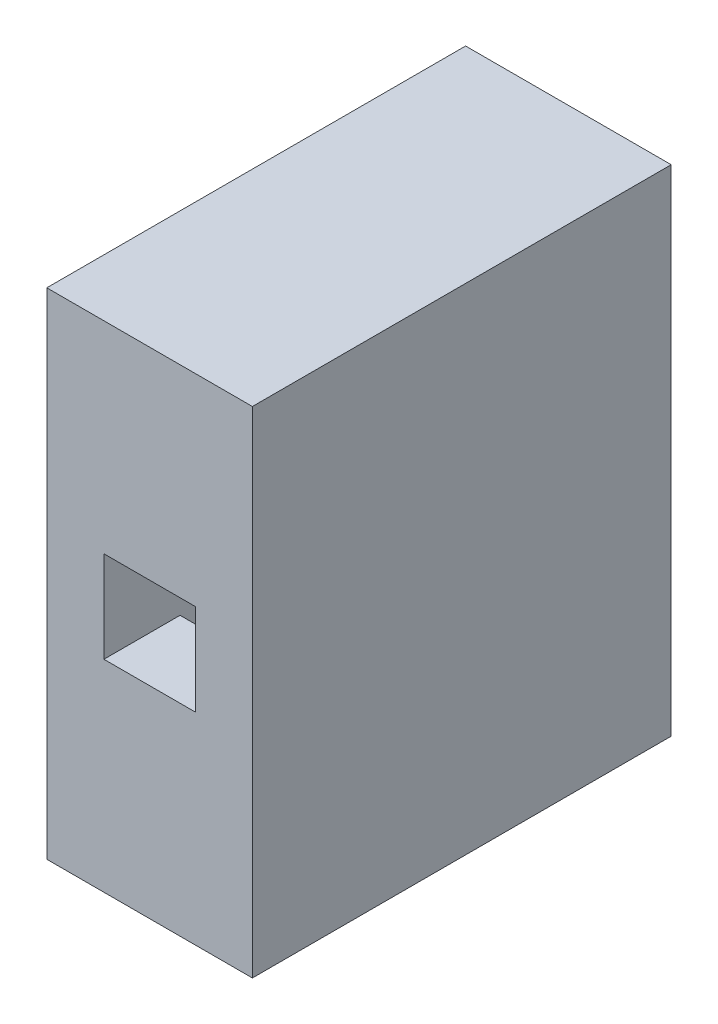
ISO-10303-21;
HEADER;
FILE_DESCRIPTION(('STEP AP214'),'2;1');
FILE_NAME('part.step','',(''),(''),'','','');
FILE_SCHEMA(('AUTOMOTIVE_DESIGN { 1 0 10303 214 1 1 1 1 }'));
ENDSEC;
DATA;
#1=APPLICATION_CONTEXT('core data for automotive mechanical design processes');
#2=APPLICATION_PROTOCOL_DEFINITION('international standard','automotive_design',2000,#1);
#3=PRODUCT_CONTEXT('',#1,'mechanical');
#4=PRODUCT('Part','Part','',(#3));
#5=PRODUCT_RELATED_PRODUCT_CATEGORY('part','',(#4));
#6=PRODUCT_DEFINITION_FORMATION('','',#4);
#7=PRODUCT_DEFINITION_CONTEXT('part definition',#1,'design');
#8=PRODUCT_DEFINITION('design','',#6,#7);
#9=PRODUCT_DEFINITION_SHAPE('','',#8);
#10=(LENGTH_UNIT() NAMED_UNIT(*) SI_UNIT(.MILLI.,.METRE.));
#11=(NAMED_UNIT(*) PLANE_ANGLE_UNIT() SI_UNIT($,.RADIAN.));
#12=(NAMED_UNIT(*) SI_UNIT($,.STERADIAN.) SOLID_ANGLE_UNIT());
#13=UNCERTAINTY_MEASURE_WITH_UNIT(LENGTH_MEASURE(1.E-05),#10,'distance_accuracy_value','');
#14=(GEOMETRIC_REPRESENTATION_CONTEXT(3) GLOBAL_UNCERTAINTY_ASSIGNED_CONTEXT((#13)) GLOBAL_UNIT_ASSIGNED_CONTEXT((#10,
#11,#12)) REPRESENTATION_CONTEXT('',''));
#15=CARTESIAN_POINT('',(0.,0.,0.));
#16=DIRECTION('',(0.,0.,1.));
#17=DIRECTION('',(1.,0.,0.));
#18=AXIS2_PLACEMENT_3D('',#15,#16,#17);
#19=CARTESIAN_POINT('',(0.,-13.,18.));
#20=DIRECTION('',(0.,1.,0.));
#21=DIRECTION('',(0.,0.,1.));
#22=AXIS2_PLACEMENT_3D('',#19,#20,#21);
#23=PLANE('',#22);
#24=DIRECTION('',(1.,0.,0.));
#25=VECTOR('',#24,1.);
#26=CARTESIAN_POINT('',(0.,-13.,0.));
#27=LINE('',#26,#25);
#28=CARTESIAN_POINT('',(-5.4,-13.,0.));
#29=VERTEX_POINT('',#28);
#30=CARTESIAN_POINT('',(5.4,-13.,0.));
#31=VERTEX_POINT('',#30);
#32=EDGE_CURVE('E206',#29,#31,#27,.T.);
#33=ORIENTED_EDGE('',*,*,#32,.T.);
#34=DIRECTION('',(0.,0.,-1.));
#35=VECTOR('',#34,1.);
#36=CARTESIAN_POINT('',(5.4,-13.,18.));
#37=LINE('',#36,#35);
#38=CARTESIAN_POINT('',(5.4,-13.,22.));
#39=VERTEX_POINT('',#38);
#40=EDGE_CURVE('E11',#39,#31,#37,.T.);
#41=ORIENTED_EDGE('',*,*,#40,.F.);
#42=DIRECTION('',(1.,0.,0.));
#43=VECTOR('',#42,1.);
#44=CARTESIAN_POINT('',(-5.4,-13.,22.));
#45=LINE('',#44,#43);
#46=CARTESIAN_POINT('',(-5.4,-13.,22.));
#47=VERTEX_POINT('',#46);
#48=EDGE_CURVE('E167',#47,#39,#45,.T.);
#49=ORIENTED_EDGE('',*,*,#48,.F.);
#50=DIRECTION('',(0.,0.,-1.));
#51=VECTOR('',#50,1.);
#52=CARTESIAN_POINT('',(-5.4,-13.,18.));
#53=LINE('',#52,#51);
#54=EDGE_CURVE('E184',#47,#29,#53,.T.);
#55=ORIENTED_EDGE('',*,*,#54,.T.);
#56=EDGE_LOOP('',(#33,#41,#49,#55));
#57=FACE_BOUND('',#56,.T.);
#58=ADVANCED_FACE('F35',(#57),#23,.F.);
#59=CARTESIAN_POINT('',(5.4,0.,18.));
#60=DIRECTION('',(-1.,0.,0.));
#61=DIRECTION('',(0.,0.,1.));
#62=AXIS2_PLACEMENT_3D('',#59,#60,#61);
#63=PLANE('',#62);
#64=DIRECTION('',(0.,1.,0.));
#65=VECTOR('',#64,1.);
#66=CARTESIAN_POINT('',(5.4,0.,0.));
#67=LINE('',#66,#65);
#68=CARTESIAN_POINT('',(5.4,13.,0.));
#69=VERTEX_POINT('',#68);
#70=EDGE_CURVE('E203',#31,#69,#67,.T.);
#71=ORIENTED_EDGE('',*,*,#70,.T.);
#72=DIRECTION('',(0.,0.,-1.));
#73=VECTOR('',#72,1.);
#74=CARTESIAN_POINT('',(5.4,13.,18.));
#75=LINE('',#74,#73);
#76=CARTESIAN_POINT('',(5.4,13.,22.));
#77=VERTEX_POINT('',#76);
#78=EDGE_CURVE('E44',#77,#69,#75,.T.);
#79=ORIENTED_EDGE('',*,*,#78,.F.);
#80=DIRECTION('',(0.,1.,0.));
#81=VECTOR('',#80,1.);
#82=CARTESIAN_POINT('',(5.4,-13.,22.));
#83=LINE('',#82,#81);
#84=EDGE_CURVE('E148',#39,#77,#83,.T.);
#85=ORIENTED_EDGE('',*,*,#84,.F.);
#86=ORIENTED_EDGE('',*,*,#40,.T.);
#87=EDGE_LOOP('',(#71,#79,#85,#86));
#88=FACE_BOUND('',#87,.T.);
#89=ADVANCED_FACE('F268',(#88),#63,.F.);
#90=CARTESIAN_POINT('',(0.,13.,18.));
#91=DIRECTION('',(0.,1.,0.));
#92=DIRECTION('',(0.,0.,1.));
#93=AXIS2_PLACEMENT_3D('',#90,#91,#92);
#94=PLANE('',#93);
#95=DIRECTION('',(1.,0.,0.));
#96=VECTOR('',#95,1.);
#97=CARTESIAN_POINT('',(0.,13.,0.));
#98=LINE('',#97,#96);
#99=CARTESIAN_POINT('',(-5.4,13.,0.));
#100=VERTEX_POINT('',#99);
#101=EDGE_CURVE('E200',#100,#69,#98,.T.);
#102=ORIENTED_EDGE('',*,*,#101,.F.);
#103=DIRECTION('',(0.,0.,-1.));
#104=VECTOR('',#103,1.);
#105=CARTESIAN_POINT('',(-5.4,13.,18.));
#106=LINE('',#105,#104);
#107=CARTESIAN_POINT('',(-5.4,13.,22.));
#108=VERTEX_POINT('',#107);
#109=EDGE_CURVE('E194',#108,#100,#106,.T.);
#110=ORIENTED_EDGE('',*,*,#109,.F.);
#111=DIRECTION('',(-1.,0.,0.));
#112=VECTOR('',#111,1.);
#113=CARTESIAN_POINT('',(-5.4,13.,22.));
#114=LINE('',#113,#112);
#115=EDGE_CURVE('E161',#77,#108,#114,.T.);
#116=ORIENTED_EDGE('',*,*,#115,.F.);
#117=ORIENTED_EDGE('',*,*,#78,.T.);
#118=EDGE_LOOP('',(#102,#110,#116,#117));
#119=FACE_BOUND('',#118,.T.);
#120=ADVANCED_FACE('F274',(#119),#94,.T.);
#121=CARTESIAN_POINT('',(2.4,0.,18.));
#122=DIRECTION('',(-1.,0.,0.));
#123=DIRECTION('',(0.,0.,1.));
#124=AXIS2_PLACEMENT_3D('',#121,#122,#123);
#125=PLANE('',#124);
#126=DIRECTION('',(0.,1.,0.));
#127=VECTOR('',#126,1.);
#128=CARTESIAN_POINT('',(2.4,0.,0.));
#129=LINE('',#128,#127);
#130=CARTESIAN_POINT('',(2.4,-10.,0.));
#131=VERTEX_POINT('',#130);
#132=CARTESIAN_POINT('',(2.4,10.,0.));
#133=VERTEX_POINT('',#132);
#134=EDGE_CURVE('E170',#131,#133,#129,.T.);
#135=ORIENTED_EDGE('',*,*,#134,.F.);
#136=DIRECTION('',(0.,0.,-1.));
#137=VECTOR('',#136,1.);
#138=CARTESIAN_POINT('',(2.4,-10.,18.));
#139=LINE('',#138,#137);
#140=CARTESIAN_POINT('',(2.4,-10.,18.));
#141=VERTEX_POINT('',#140);
#142=EDGE_CURVE('E182',#141,#131,#139,.T.);
#143=ORIENTED_EDGE('',*,*,#142,.F.);
#144=DIRECTION('',(0.,1.,0.));
#145=VECTOR('',#144,1.);
#146=CARTESIAN_POINT('',(2.4,0.,18.));
#147=LINE('',#146,#145);
#148=CARTESIAN_POINT('',(2.4,-2.4,18.));
#149=VERTEX_POINT('',#148);
#150=EDGE_CURVE('E180',#141,#149,#147,.T.);
#151=ORIENTED_EDGE('',*,*,#150,.T.);
#152=DIRECTION('',(0.,0.,-1.));
#153=VECTOR('',#152,1.);
#154=CARTESIAN_POINT('',(2.4,-2.4,22.));
#155=LINE('',#154,#153);
#156=CARTESIAN_POINT('',(2.4,-2.4,22.));
#157=VERTEX_POINT('',#156);
#158=EDGE_CURVE('E136',#157,#149,#155,.T.);
#159=ORIENTED_EDGE('',*,*,#158,.F.);
#160=DIRECTION('',(0.,1.,0.));
#161=VECTOR('',#160,1.);
#162=CARTESIAN_POINT('',(2.4,2.4,22.));
#163=LINE('',#162,#161);
#164=CARTESIAN_POINT('',(2.4,2.4,22.));
#165=VERTEX_POINT('',#164);
#166=EDGE_CURVE('E130',#157,#165,#163,.T.);
#167=ORIENTED_EDGE('',*,*,#166,.T.);
#168=DIRECTION('',(0.,0.,-1.));
#169=VECTOR('',#168,1.);
#170=CARTESIAN_POINT('',(2.4,2.4,22.));
#171=LINE('',#170,#169);
#172=CARTESIAN_POINT('',(2.4,2.4,18.));
#173=VERTEX_POINT('',#172);
#174=EDGE_CURVE('E134',#165,#173,#171,.T.);
#175=ORIENTED_EDGE('',*,*,#174,.T.);
#176=CARTESIAN_POINT('',(2.4,10.,18.));
#177=VERTEX_POINT('',#176);
#178=EDGE_CURVE('E177',#173,#177,#147,.T.);
#179=ORIENTED_EDGE('',*,*,#178,.T.);
#180=DIRECTION('',(0.,0.,-1.));
#181=VECTOR('',#180,1.);
#182=CARTESIAN_POINT('',(2.4,10.,18.));
#183=LINE('',#182,#181);
#184=EDGE_CURVE('E190',#177,#133,#183,.T.);
#185=ORIENTED_EDGE('',*,*,#184,.T.);
#186=EDGE_LOOP('',(#135,#143,#151,#159,#167,#175,#179,#185));
#187=FACE_BOUND('',#186,.T.);
#188=ADVANCED_FACE('F37',(#187),#125,.T.);
#189=CARTESIAN_POINT('',(0.,-10.,18.));
#190=DIRECTION('',(0.,1.,0.));
#191=DIRECTION('',(0.,0.,1.));
#192=AXIS2_PLACEMENT_3D('',#189,#190,#191);
#193=PLANE('',#192);
#194=DIRECTION('',(1.,0.,0.));
#195=VECTOR('',#194,1.);
#196=CARTESIAN_POINT('',(0.,-10.,0.));
#197=LINE('',#196,#195);
#198=CARTESIAN_POINT('',(-2.4,-10.,0.));
#199=VERTEX_POINT('',#198);
#200=EDGE_CURVE('E214',#199,#131,#197,.T.);
#201=ORIENTED_EDGE('',*,*,#200,.F.);
#202=DIRECTION('',(0.,0.,-1.));
#203=VECTOR('',#202,1.);
#204=CARTESIAN_POINT('',(-2.4,-10.,18.));
#205=LINE('',#204,#203);
#206=CARTESIAN_POINT('',(-2.4,-10.,18.));
#207=VERTEX_POINT('',#206);
#208=EDGE_CURVE('E185',#207,#199,#205,.T.);
#209=ORIENTED_EDGE('',*,*,#208,.F.);
#210=DIRECTION('',(1.,0.,0.));
#211=VECTOR('',#210,1.);
#212=CARTESIAN_POINT('',(0.,-10.,18.));
#213=LINE('',#212,#211);
#214=EDGE_CURVE('E173',#207,#141,#213,.T.);
#215=ORIENTED_EDGE('',*,*,#214,.T.);
#216=ORIENTED_EDGE('',*,*,#142,.T.);
#217=EDGE_LOOP('',(#201,#209,#215,#216));
#218=FACE_BOUND('',#217,.T.);
#219=ADVANCED_FACE('F229',(#218),#193,.T.);
#220=CARTESIAN_POINT('',(-2.4,0.,18.));
#221=DIRECTION('',(-1.,0.,0.));
#222=DIRECTION('',(0.,0.,1.));
#223=AXIS2_PLACEMENT_3D('',#220,#221,#222);
#224=PLANE('',#223);
#225=DIRECTION('',(0.,1.,0.));
#226=VECTOR('',#225,1.);
#227=CARTESIAN_POINT('',(-2.4,0.,0.));
#228=LINE('',#227,#226);
#229=CARTESIAN_POINT('',(-2.4,10.,0.));
#230=VERTEX_POINT('',#229);
#231=EDGE_CURVE('E212',#199,#230,#228,.T.);
#232=ORIENTED_EDGE('',*,*,#231,.T.);
#233=DIRECTION('',(0.,0.,-1.));
#234=VECTOR('',#233,1.);
#235=CARTESIAN_POINT('',(-2.4,10.,18.));
#236=LINE('',#235,#234);
#237=CARTESIAN_POINT('',(-2.4,10.,18.));
#238=VERTEX_POINT('',#237);
#239=EDGE_CURVE('E187',#238,#230,#236,.T.);
#240=ORIENTED_EDGE('',*,*,#239,.F.);
#241=DIRECTION('',(0.,1.,0.));
#242=VECTOR('',#241,1.);
#243=CARTESIAN_POINT('',(-2.4,0.,18.));
#244=LINE('',#243,#242);
#245=CARTESIAN_POINT('',(-2.4,2.4,18.));
#246=VERTEX_POINT('',#245);
#247=EDGE_CURVE('E52',#246,#238,#244,.T.);
#248=ORIENTED_EDGE('',*,*,#247,.F.);
#249=DIRECTION('',(0.,0.,-1.));
#250=VECTOR('',#249,1.);
#251=CARTESIAN_POINT('',(-2.4,2.4,22.));
#252=LINE('',#251,#250);
#253=CARTESIAN_POINT('',(-2.4,2.4,22.));
#254=VERTEX_POINT('',#253);
#255=EDGE_CURVE('E149',#254,#246,#252,.T.);
#256=ORIENTED_EDGE('',*,*,#255,.F.);
#257=DIRECTION('',(0.,-1.,0.));
#258=VECTOR('',#257,1.);
#259=CARTESIAN_POINT('',(-2.4,2.4,22.));
#260=LINE('',#259,#258);
#261=CARTESIAN_POINT('',(-2.4,-2.4,22.));
#262=VERTEX_POINT('',#261);
#263=EDGE_CURVE('E153',#254,#262,#260,.T.);
#264=ORIENTED_EDGE('',*,*,#263,.T.);
#265=DIRECTION('',(0.,0.,-1.));
#266=VECTOR('',#265,1.);
#267=CARTESIAN_POINT('',(-2.4,-2.4,22.));
#268=LINE('',#267,#266);
#269=CARTESIAN_POINT('',(-2.4,-2.4,18.));
#270=VERTEX_POINT('',#269);
#271=EDGE_CURVE('E234',#262,#270,#268,.T.);
#272=ORIENTED_EDGE('',*,*,#271,.T.);
#273=EDGE_CURVE('E60',#207,#270,#244,.T.);
#274=ORIENTED_EDGE('',*,*,#273,.F.);
#275=ORIENTED_EDGE('',*,*,#208,.T.);
#276=EDGE_LOOP('',(#232,#240,#248,#256,#264,#272,#274,#275));
#277=FACE_BOUND('',#276,.T.);
#278=ADVANCED_FACE('F258',(#277),#224,.F.);
#279=CARTESIAN_POINT('',(0.,10.,18.));
#280=DIRECTION('',(0.,1.,0.));
#281=DIRECTION('',(0.,0.,1.));
#282=AXIS2_PLACEMENT_3D('',#279,#280,#281);
#283=PLANE('',#282);
#284=DIRECTION('',(1.,0.,0.));
#285=VECTOR('',#284,1.);
#286=CARTESIAN_POINT('',(0.,10.,0.));
#287=LINE('',#286,#285);
#288=EDGE_CURVE('E209',#230,#133,#287,.T.);
#289=ORIENTED_EDGE('',*,*,#288,.T.);
#290=ORIENTED_EDGE('',*,*,#184,.F.);
#291=DIRECTION('',(1.,0.,0.));
#292=VECTOR('',#291,1.);
#293=CARTESIAN_POINT('',(0.,10.,18.));
#294=LINE('',#293,#292);
#295=EDGE_CURVE('E191',#238,#177,#294,.T.);
#296=ORIENTED_EDGE('',*,*,#295,.F.);
#297=ORIENTED_EDGE('',*,*,#239,.T.);
#298=EDGE_LOOP('',(#289,#290,#296,#297));
#299=FACE_BOUND('',#298,.T.);
#300=ADVANCED_FACE('F253',(#299),#283,.F.);
#301=CARTESIAN_POINT('',(-5.4,0.,18.));
#302=DIRECTION('',(-1.,0.,0.));
#303=DIRECTION('',(0.,0.,1.));
#304=AXIS2_PLACEMENT_3D('',#301,#302,#303);
#305=PLANE('',#304);
#306=DIRECTION('',(0.,1.,0.));
#307=VECTOR('',#306,1.);
#308=CARTESIAN_POINT('',(-5.4,0.,0.));
#309=LINE('',#308,#307);
#310=EDGE_CURVE('E197',#29,#100,#309,.T.);
#311=ORIENTED_EDGE('',*,*,#310,.F.);
#312=ORIENTED_EDGE('',*,*,#54,.F.);
#313=DIRECTION('',(0.,-1.,0.));
#314=VECTOR('',#313,1.);
#315=CARTESIAN_POINT('',(-5.4,-13.,22.));
#316=LINE('',#315,#314);
#317=EDGE_CURVE('E164',#108,#47,#316,.T.);
#318=ORIENTED_EDGE('',*,*,#317,.F.);
#319=ORIENTED_EDGE('',*,*,#109,.T.);
#320=EDGE_LOOP('',(#311,#312,#318,#319));
#321=FACE_BOUND('',#320,.T.);
#322=ADVANCED_FACE('F265',(#321),#305,.T.);
#323=CARTESIAN_POINT('',(0.,0.,0.));
#324=DIRECTION('',(0.,0.,1.));
#325=DIRECTION('',(1.,0.,0.));
#326=AXIS2_PLACEMENT_3D('',#323,#324,#325);
#327=PLANE('',#326);
#328=ORIENTED_EDGE('',*,*,#134,.T.);
#329=ORIENTED_EDGE('',*,*,#288,.F.);
#330=ORIENTED_EDGE('',*,*,#231,.F.);
#331=ORIENTED_EDGE('',*,*,#200,.T.);
#332=EDGE_LOOP('',(#328,#329,#330,#331));
#333=FACE_BOUND('',#332,.T.);
#334=ORIENTED_EDGE('',*,*,#32,.F.);
#335=ORIENTED_EDGE('',*,*,#310,.T.);
#336=ORIENTED_EDGE('',*,*,#101,.T.);
#337=ORIENTED_EDGE('',*,*,#70,.F.);
#338=EDGE_LOOP('',(#334,#335,#336,#337));
#339=FACE_BOUND('',#338,.T.);
#340=ADVANCED_FACE('F256',(#333,#339),#327,.F.);
#341=CARTESIAN_POINT('',(0.,0.,18.));
#342=DIRECTION('',(0.,0.,-1.));
#343=DIRECTION('',(-1.,0.,0.));
#344=AXIS2_PLACEMENT_3D('',#341,#342,#343);
#345=PLANE('',#344);
#346=ORIENTED_EDGE('',*,*,#150,.F.);
#347=ORIENTED_EDGE('',*,*,#214,.F.);
#348=ORIENTED_EDGE('',*,*,#273,.T.);
#349=DIRECTION('',(1.,0.,0.));
#350=VECTOR('',#349,1.);
#351=CARTESIAN_POINT('',(-2.4,-2.4,18.));
#352=LINE('',#351,#350);
#353=EDGE_CURVE('E141',#270,#149,#352,.T.);
#354=ORIENTED_EDGE('',*,*,#353,.T.);
#355=EDGE_LOOP('',(#346,#347,#348,#354));
#356=FACE_BOUND('',#355,.T.);
#357=ADVANCED_FACE('F230',(#356),#345,.T.);
#358=ORIENTED_EDGE('',*,*,#178,.F.);
#359=DIRECTION('',(-1.,0.,0.));
#360=VECTOR('',#359,1.);
#361=CARTESIAN_POINT('',(-2.4,2.4,18.));
#362=LINE('',#361,#360);
#363=EDGE_CURVE('E147',#173,#246,#362,.T.);
#364=ORIENTED_EDGE('',*,*,#363,.T.);
#365=ORIENTED_EDGE('',*,*,#247,.T.);
#366=ORIENTED_EDGE('',*,*,#295,.T.);
#367=EDGE_LOOP('',(#358,#364,#365,#366));
#368=FACE_BOUND('',#367,.T.);
#369=ADVANCED_FACE('F249',(#368),#345,.T.);
#370=CARTESIAN_POINT('',(0.,0.,22.));
#371=DIRECTION('',(0.,0.,-1.));
#372=DIRECTION('',(-1.,0.,0.));
#373=AXIS2_PLACEMENT_3D('',#370,#371,#372);
#374=PLANE('',#373);
#375=ORIENTED_EDGE('',*,*,#84,.T.);
#376=ORIENTED_EDGE('',*,*,#115,.T.);
#377=ORIENTED_EDGE('',*,*,#317,.T.);
#378=ORIENTED_EDGE('',*,*,#48,.T.);
#379=EDGE_LOOP('',(#375,#376,#377,#378));
#380=FACE_BOUND('',#379,.T.);
#381=ORIENTED_EDGE('',*,*,#166,.F.);
#382=DIRECTION('',(1.,0.,0.));
#383=VECTOR('',#382,1.);
#384=CARTESIAN_POINT('',(-2.4,-2.4,22.));
#385=LINE('',#384,#383);
#386=EDGE_CURVE('E155',#262,#157,#385,.T.);
#387=ORIENTED_EDGE('',*,*,#386,.F.);
#388=ORIENTED_EDGE('',*,*,#263,.F.);
#389=DIRECTION('',(-1.,0.,0.));
#390=VECTOR('',#389,1.);
#391=CARTESIAN_POINT('',(-2.4,2.4,22.));
#392=LINE('',#391,#390);
#393=EDGE_CURVE('E140',#165,#254,#392,.T.);
#394=ORIENTED_EDGE('',*,*,#393,.F.);
#395=EDGE_LOOP('',(#381,#387,#388,#394));
#396=FACE_BOUND('',#395,.T.);
#397=ADVANCED_FACE('F151',(#380,#396),#374,.F.);
#398=CARTESIAN_POINT('',(-2.4,2.4,22.));
#399=DIRECTION('',(0.,-1.,0.));
#400=DIRECTION('',(0.,0.,-1.));
#401=AXIS2_PLACEMENT_3D('',#398,#399,#400);
#402=PLANE('',#401);
#403=ORIENTED_EDGE('',*,*,#363,.F.);
#404=ORIENTED_EDGE('',*,*,#174,.F.);
#405=ORIENTED_EDGE('',*,*,#393,.T.);
#406=ORIENTED_EDGE('',*,*,#255,.T.);
#407=EDGE_LOOP('',(#403,#404,#405,#406));
#408=FACE_BOUND('',#407,.T.);
#409=ADVANCED_FACE('F145',(#408),#402,.T.);
#410=CARTESIAN_POINT('',(-2.4,-2.4,22.));
#411=DIRECTION('',(0.,1.,0.));
#412=DIRECTION('',(0.,0.,1.));
#413=AXIS2_PLACEMENT_3D('',#410,#411,#412);
#414=PLANE('',#413);
#415=ORIENTED_EDGE('',*,*,#353,.F.);
#416=ORIENTED_EDGE('',*,*,#271,.F.);
#417=ORIENTED_EDGE('',*,*,#386,.T.);
#418=ORIENTED_EDGE('',*,*,#158,.T.);
#419=EDGE_LOOP('',(#415,#416,#417,#418));
#420=FACE_BOUND('',#419,.T.);
#421=ADVANCED_FACE('F233',(#420),#414,.T.);
#422=CLOSED_SHELL('',(#58,#89,#120,#188,#219,#278,#300,#322,#340,#357,#369,#397,#409,#421));
#423=MANIFOLD_SOLID_BREP('B2',#422);
#424=ADVANCED_BREP_SHAPE_REPRESENTATION('',(#18,#423),#14);
#425=SHAPE_DEFINITION_REPRESENTATION(#9,#424);
ENDSEC;
END-ISO-10303-21;
